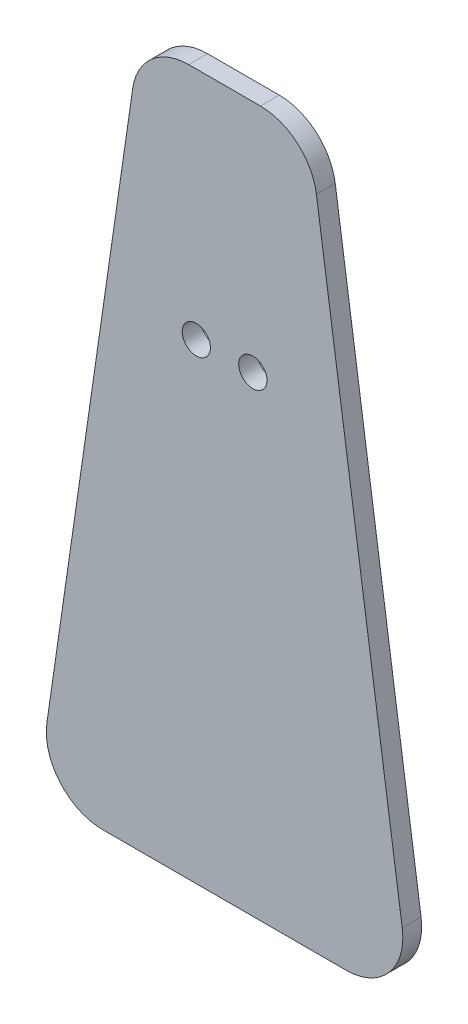
ISO-10303-21;
HEADER;
FILE_DESCRIPTION(('STEP AP214'),'2;1');
FILE_NAME('part.step','',(''),(''),'','','');
FILE_SCHEMA(('AUTOMOTIVE_DESIGN { 1 0 10303 214 1 1 1 1 }'));
ENDSEC;
DATA;
#1=APPLICATION_CONTEXT('core data for automotive mechanical design processes');
#2=APPLICATION_PROTOCOL_DEFINITION('international standard','automotive_design',2000,#1);
#3=PRODUCT_CONTEXT('',#1,'mechanical');
#4=PRODUCT('Part','Part','',(#3));
#5=PRODUCT_RELATED_PRODUCT_CATEGORY('part','',(#4));
#6=PRODUCT_DEFINITION_FORMATION('','',#4);
#7=PRODUCT_DEFINITION_CONTEXT('part definition',#1,'design');
#8=PRODUCT_DEFINITION('design','',#6,#7);
#9=PRODUCT_DEFINITION_SHAPE('','',#8);
#10=(LENGTH_UNIT() NAMED_UNIT(*) SI_UNIT(.MILLI.,.METRE.));
#11=(NAMED_UNIT(*) PLANE_ANGLE_UNIT() SI_UNIT($,.RADIAN.));
#12=(NAMED_UNIT(*) SI_UNIT($,.STERADIAN.) SOLID_ANGLE_UNIT());
#13=UNCERTAINTY_MEASURE_WITH_UNIT(LENGTH_MEASURE(1.E-05),#10,'distance_accuracy_value','');
#14=(GEOMETRIC_REPRESENTATION_CONTEXT(3) GLOBAL_UNCERTAINTY_ASSIGNED_CONTEXT((#13)) GLOBAL_UNIT_ASSIGNED_CONTEXT((#10,
#11,#12)) REPRESENTATION_CONTEXT('',''));
#15=CARTESIAN_POINT('',(0.,0.,0.));
#16=DIRECTION('',(0.,0.,1.));
#17=DIRECTION('',(1.,0.,0.));
#18=AXIS2_PLACEMENT_3D('',#15,#16,#17);
#19=CARTESIAN_POINT('',(-3.80670017831718,68.8779454447492,2.));
#20=DIRECTION('',(0.,0.,-1.));
#21=DIRECTION('',(-1.,0.,0.));
#22=AXIS2_PLACEMENT_3D('',#19,#20,#21);
#23=PLANE('',#22);
#24=DIRECTION('',(-1.,0.,0.));
#25=VECTOR('',#24,1.);
#26=CARTESIAN_POINT('',(0.,74.8779454447492,2.));
#27=LINE('',#26,#25);
#28=CARTESIAN_POINT('',(3.80670017831714,74.8779454447492,2.));
#29=VERTEX_POINT('',#28);
#30=CARTESIAN_POINT('',(-3.80670017831714,74.8779454447492,2.));
#31=VERTEX_POINT('',#30);
#32=EDGE_CURVE('E57',#29,#31,#27,.T.);
#33=ORIENTED_EDGE('',*,*,#32,.T.);
#34=CARTESIAN_POINT('',(-3.80670017831718,68.8779454447492,2.));
#35=DIRECTION('',(0.,0.,1.));
#36=DIRECTION('',(-1.,0.,0.));
#37=AXIS2_PLACEMENT_3D('',#34,#35,#36);
#38=CIRCLE('',#37,6.);
#39=CARTESIAN_POINT('',(-9.74469337261031,69.7383156119031,2.));
#40=VERTEX_POINT('',#39);
#41=EDGE_CURVE('E101',#31,#40,#38,.T.);
#42=ORIENTED_EDGE('',*,*,#41,.T.);
#43=DIRECTION('',(-0.143395027858991,-0.989665532382188,0.));
#44=VECTOR('',#43,1.);
#45=CARTESIAN_POINT('',(-9.74469337261031,69.7383156119031,2.));
#46=LINE('',#45,#44);
#47=CARTESIAN_POINT('',(-18.8552306639949,6.86037016715395,2.));
#48=VERTEX_POINT('',#47);
#49=EDGE_CURVE('E187',#40,#48,#46,.T.);
#50=ORIENTED_EDGE('',*,*,#49,.T.);
#51=CARTESIAN_POINT('',(-12.9172374697018,6.,2.));
#52=DIRECTION('',(0.,0.,1.));
#53=DIRECTION('',(1.,0.,0.));
#54=AXIS2_PLACEMENT_3D('',#51,#52,#53);
#55=CIRCLE('',#54,6.);
#56=CARTESIAN_POINT('',(-12.9172374697017,0.,2.));
#57=VERTEX_POINT('',#56);
#58=EDGE_CURVE('E202',#48,#57,#55,.T.);
#59=ORIENTED_EDGE('',*,*,#58,.T.);
#60=DIRECTION('',(1.,0.,0.));
#61=VECTOR('',#60,1.);
#62=CARTESIAN_POINT('',(-12.9172374697017,0.,2.));
#63=LINE('',#62,#61);
#64=CARTESIAN_POINT('',(12.9172374697017,0.,2.));
#65=VERTEX_POINT('',#64);
#66=EDGE_CURVE('E121',#57,#65,#63,.T.);
#67=ORIENTED_EDGE('',*,*,#66,.T.);
#68=CARTESIAN_POINT('',(12.9172374697018,6.,2.));
#69=DIRECTION('',(0.,0.,1.));
#70=DIRECTION('',(1.,0.,0.));
#71=AXIS2_PLACEMENT_3D('',#68,#69,#70);
#72=CIRCLE('',#71,6.);
#73=CARTESIAN_POINT('',(18.8552306639949,6.86037016715395,2.));
#74=VERTEX_POINT('',#73);
#75=EDGE_CURVE('E115',#65,#74,#72,.T.);
#76=ORIENTED_EDGE('',*,*,#75,.T.);
#77=DIRECTION('',(-0.143395027858991,0.989665532382188,0.));
#78=VECTOR('',#77,1.);
#79=CARTESIAN_POINT('',(9.7446933726103,69.7383156119031,2.));
#80=LINE('',#79,#78);
#81=CARTESIAN_POINT('',(9.74469337261031,69.7383156119031,2.));
#82=VERTEX_POINT('',#81);
#83=EDGE_CURVE('E119',#74,#82,#80,.T.);
#84=ORIENTED_EDGE('',*,*,#83,.T.);
#85=CARTESIAN_POINT('',(3.80670017831717,68.8779454447492,2.));
#86=DIRECTION('',(0.,0.,1.));
#87=DIRECTION('',(1.,0.,0.));
#88=AXIS2_PLACEMENT_3D('',#85,#86,#87);
#89=CIRCLE('',#88,6.);
#90=EDGE_CURVE('E138',#82,#29,#89,.T.);
#91=ORIENTED_EDGE('',*,*,#90,.T.);
#92=EDGE_LOOP('',(#33,#42,#50,#59,#67,#76,#84,#91));
#93=FACE_BOUND('',#92,.T.);
#94=CARTESIAN_POINT('',(-3.00000000000001,50.,2.));
#95=DIRECTION('',(0.,0.,1.));
#96=DIRECTION('',(1.,0.,0.));
#97=AXIS2_PLACEMENT_3D('',#94,#95,#96);
#98=CIRCLE('',#97,1.5);
#99=CARTESIAN_POINT('',(-1.50000000000001,50.,2.));
#100=VERTEX_POINT('',#99);
#101=EDGE_CURVE('E149',#100,#100,#98,.T.);
#102=ORIENTED_EDGE('',*,*,#101,.F.);
#103=EDGE_LOOP('',(#102));
#104=FACE_BOUND('',#103,.T.);
#105=CARTESIAN_POINT('',(2.99999999999999,50.,2.));
#106=DIRECTION('',(0.,0.,1.));
#107=DIRECTION('',(1.,0.,0.));
#108=AXIS2_PLACEMENT_3D('',#105,#106,#107);
#109=CIRCLE('',#108,1.5);
#110=CARTESIAN_POINT('',(4.49999999999999,50.,2.));
#111=VERTEX_POINT('',#110);
#112=EDGE_CURVE('E216',#111,#111,#109,.T.);
#113=ORIENTED_EDGE('',*,*,#112,.F.);
#114=EDGE_LOOP('',(#113));
#115=FACE_BOUND('',#114,.T.);
#116=ADVANCED_FACE('F39',(#93,#104,#115),#23,.F.);
#117=CARTESIAN_POINT('',(-3.80670017831718,68.8779454447492,0.));
#118=DIRECTION('',(0.,0.,-1.));
#119=DIRECTION('',(-1.,0.,0.));
#120=AXIS2_PLACEMENT_3D('',#117,#118,#119);
#121=PLANE('',#120);
#122=CARTESIAN_POINT('',(-3.00000000000001,50.,0.));
#123=DIRECTION('',(0.,0.,1.));
#124=DIRECTION('',(1.,0.,0.));
#125=AXIS2_PLACEMENT_3D('',#122,#123,#124);
#126=CIRCLE('',#125,1.5);
#127=CARTESIAN_POINT('',(-1.50000000000001,50.,0.));
#128=VERTEX_POINT('',#127);
#129=EDGE_CURVE('E212',#128,#128,#126,.T.);
#130=ORIENTED_EDGE('',*,*,#129,.T.);
#131=EDGE_LOOP('',(#130));
#132=FACE_BOUND('',#131,.T.);
#133=CARTESIAN_POINT('',(-3.80670017831718,68.8779454447492,0.));
#134=DIRECTION('',(0.,0.,1.));
#135=DIRECTION('',(-1.,0.,0.));
#136=AXIS2_PLACEMENT_3D('',#133,#134,#135);
#137=CIRCLE('',#136,6.);
#138=CARTESIAN_POINT('',(-3.80670017831714,74.8779454447492,0.));
#139=VERTEX_POINT('',#138);
#140=CARTESIAN_POINT('',(-9.74469337261031,69.7383156119031,0.));
#141=VERTEX_POINT('',#140);
#142=EDGE_CURVE('E145',#139,#141,#137,.T.);
#143=ORIENTED_EDGE('',*,*,#142,.F.);
#144=DIRECTION('',(-1.,0.,0.));
#145=VECTOR('',#144,1.);
#146=CARTESIAN_POINT('',(0.,74.8779454447492,0.));
#147=LINE('',#146,#145);
#148=CARTESIAN_POINT('',(3.80670017831714,74.8779454447492,0.));
#149=VERTEX_POINT('',#148);
#150=EDGE_CURVE('E164',#149,#139,#147,.T.);
#151=ORIENTED_EDGE('',*,*,#150,.F.);
#152=CARTESIAN_POINT('',(3.80670017831717,68.8779454447492,0.));
#153=DIRECTION('',(0.,0.,1.));
#154=DIRECTION('',(1.,0.,0.));
#155=AXIS2_PLACEMENT_3D('',#152,#153,#154);
#156=CIRCLE('',#155,6.);
#157=CARTESIAN_POINT('',(9.74469337261031,69.7383156119031,0.));
#158=VERTEX_POINT('',#157);
#159=EDGE_CURVE('E94',#158,#149,#156,.T.);
#160=ORIENTED_EDGE('',*,*,#159,.F.);
#161=DIRECTION('',(-0.143395027858991,0.989665532382188,0.));
#162=VECTOR('',#161,1.);
#163=CARTESIAN_POINT('',(9.7446933726103,69.7383156119031,0.));
#164=LINE('',#163,#162);
#165=CARTESIAN_POINT('',(18.8552306639949,6.86037016715395,0.));
#166=VERTEX_POINT('',#165);
#167=EDGE_CURVE('E87',#166,#158,#164,.T.);
#168=ORIENTED_EDGE('',*,*,#167,.F.);
#169=CARTESIAN_POINT('',(12.9172374697018,6.,0.));
#170=DIRECTION('',(0.,0.,1.));
#171=DIRECTION('',(1.,0.,0.));
#172=AXIS2_PLACEMENT_3D('',#169,#170,#171);
#173=CIRCLE('',#172,6.);
#174=CARTESIAN_POINT('',(12.9172374697017,0.,0.));
#175=VERTEX_POINT('',#174);
#176=EDGE_CURVE('E130',#175,#166,#173,.T.);
#177=ORIENTED_EDGE('',*,*,#176,.F.);
#178=DIRECTION('',(1.,0.,0.));
#179=VECTOR('',#178,1.);
#180=CARTESIAN_POINT('',(-12.9172374697017,0.,0.));
#181=LINE('',#180,#179);
#182=CARTESIAN_POINT('',(-12.9172374697017,0.,0.));
#183=VERTEX_POINT('',#182);
#184=EDGE_CURVE('E155',#183,#175,#181,.T.);
#185=ORIENTED_EDGE('',*,*,#184,.F.);
#186=CARTESIAN_POINT('',(-12.9172374697018,6.,0.));
#187=DIRECTION('',(0.,0.,1.));
#188=DIRECTION('',(1.,0.,0.));
#189=AXIS2_PLACEMENT_3D('',#186,#187,#188);
#190=CIRCLE('',#189,6.);
#191=CARTESIAN_POINT('',(-18.8552306639949,6.86037016715395,0.));
#192=VERTEX_POINT('',#191);
#193=EDGE_CURVE('E152',#192,#183,#190,.T.);
#194=ORIENTED_EDGE('',*,*,#193,.F.);
#195=DIRECTION('',(-0.143395027858991,-0.989665532382188,0.));
#196=VECTOR('',#195,1.);
#197=CARTESIAN_POINT('',(-9.74469337261031,69.7383156119031,0.));
#198=LINE('',#197,#196);
#199=EDGE_CURVE('E148',#141,#192,#198,.T.);
#200=ORIENTED_EDGE('',*,*,#199,.F.);
#201=EDGE_LOOP('',(#143,#151,#160,#168,#177,#185,#194,#200));
#202=FACE_BOUND('',#201,.T.);
#203=CARTESIAN_POINT('',(2.99999999999999,50.,0.));
#204=DIRECTION('',(0.,0.,1.));
#205=DIRECTION('',(1.,0.,0.));
#206=AXIS2_PLACEMENT_3D('',#203,#204,#205);
#207=CIRCLE('',#206,1.5);
#208=CARTESIAN_POINT('',(4.49999999999999,50.,0.));
#209=VERTEX_POINT('',#208);
#210=EDGE_CURVE('E220',#209,#209,#207,.T.);
#211=ORIENTED_EDGE('',*,*,#210,.T.);
#212=EDGE_LOOP('',(#211));
#213=FACE_BOUND('',#212,.T.);
#214=ADVANCED_FACE('F191',(#132,#202,#213),#121,.T.);
#215=CARTESIAN_POINT('',(-3.80670017831718,68.8779454447492,2.));
#216=DIRECTION('',(0.,0.,-1.));
#217=DIRECTION('',(-1.,0.,0.));
#218=AXIS2_PLACEMENT_3D('',#215,#216,#217);
#219=CYLINDRICAL_SURFACE('',#218,6.);
#220=ORIENTED_EDGE('',*,*,#142,.T.);
#221=DIRECTION('',(0.,0.,-1.));
#222=VECTOR('',#221,1.);
#223=CARTESIAN_POINT('',(-9.74469337261031,69.7383156119031,2.));
#224=LINE('',#223,#222);
#225=EDGE_CURVE('E49',#40,#141,#224,.T.);
#226=ORIENTED_EDGE('',*,*,#225,.F.);
#227=ORIENTED_EDGE('',*,*,#41,.F.);
#228=DIRECTION('',(0.,0.,-1.));
#229=VECTOR('',#228,1.);
#230=CARTESIAN_POINT('',(-3.80670017831714,74.8779454447492,2.));
#231=LINE('',#230,#229);
#232=EDGE_CURVE('E11',#31,#139,#231,.T.);
#233=ORIENTED_EDGE('',*,*,#232,.T.);
#234=EDGE_LOOP('',(#220,#226,#227,#233));
#235=FACE_BOUND('',#234,.T.);
#236=ADVANCED_FACE('F41',(#235),#219,.T.);
#237=CARTESIAN_POINT('',(-9.74469337261031,69.7383156119031,2.));
#238=DIRECTION('',(0.989665532382188,-0.143395027858991,0.));
#239=DIRECTION('',(0.143395027858991,0.989665532382188,0.));
#240=AXIS2_PLACEMENT_3D('',#237,#238,#239);
#241=PLANE('',#240);
#242=ORIENTED_EDGE('',*,*,#199,.T.);
#243=DIRECTION('',(0.,0.,-1.));
#244=VECTOR('',#243,1.);
#245=CARTESIAN_POINT('',(-18.8552306639949,6.86037016715395,2.));
#246=LINE('',#245,#244);
#247=EDGE_CURVE('E177',#48,#192,#246,.T.);
#248=ORIENTED_EDGE('',*,*,#247,.F.);
#249=ORIENTED_EDGE('',*,*,#49,.F.);
#250=ORIENTED_EDGE('',*,*,#225,.T.);
#251=EDGE_LOOP('',(#242,#248,#249,#250));
#252=FACE_BOUND('',#251,.T.);
#253=ADVANCED_FACE('F185',(#252),#241,.F.);
#254=CARTESIAN_POINT('',(-12.9172374697018,6.,2.));
#255=DIRECTION('',(0.,0.,-1.));
#256=DIRECTION('',(-1.,0.,0.));
#257=AXIS2_PLACEMENT_3D('',#254,#255,#256);
#258=CYLINDRICAL_SURFACE('',#257,6.);
#259=ORIENTED_EDGE('',*,*,#193,.T.);
#260=DIRECTION('',(0.,0.,-1.));
#261=VECTOR('',#260,1.);
#262=CARTESIAN_POINT('',(-12.9172374697017,0.,2.));
#263=LINE('',#262,#261);
#264=EDGE_CURVE('E173',#57,#183,#263,.T.);
#265=ORIENTED_EDGE('',*,*,#264,.F.);
#266=ORIENTED_EDGE('',*,*,#58,.F.);
#267=ORIENTED_EDGE('',*,*,#247,.T.);
#268=EDGE_LOOP('',(#259,#265,#266,#267));
#269=FACE_BOUND('',#268,.T.);
#270=ADVANCED_FACE('F197',(#269),#258,.T.);
#271=CARTESIAN_POINT('',(-12.9172374697017,0.,2.));
#272=DIRECTION('',(0.,1.,0.));
#273=DIRECTION('',(0.,0.,1.));
#274=AXIS2_PLACEMENT_3D('',#271,#272,#273);
#275=PLANE('',#274);
#276=ORIENTED_EDGE('',*,*,#184,.T.);
#277=DIRECTION('',(0.,0.,-1.));
#278=VECTOR('',#277,1.);
#279=CARTESIAN_POINT('',(12.9172374697017,0.,2.));
#280=LINE('',#279,#278);
#281=EDGE_CURVE('E132',#65,#175,#280,.T.);
#282=ORIENTED_EDGE('',*,*,#281,.F.);
#283=ORIENTED_EDGE('',*,*,#66,.F.);
#284=ORIENTED_EDGE('',*,*,#264,.T.);
#285=EDGE_LOOP('',(#276,#282,#283,#284));
#286=FACE_BOUND('',#285,.T.);
#287=ADVANCED_FACE('F200',(#286),#275,.F.);
#288=CARTESIAN_POINT('',(12.9172374697018,6.,2.));
#289=DIRECTION('',(0.,0.,-1.));
#290=DIRECTION('',(-1.,0.,0.));
#291=AXIS2_PLACEMENT_3D('',#288,#289,#290);
#292=CYLINDRICAL_SURFACE('',#291,6.);
#293=ORIENTED_EDGE('',*,*,#176,.T.);
#294=DIRECTION('',(0.,0.,-1.));
#295=VECTOR('',#294,1.);
#296=CARTESIAN_POINT('',(18.8552306639949,6.86037016715395,2.));
#297=LINE('',#296,#295);
#298=EDGE_CURVE('E127',#74,#166,#297,.T.);
#299=ORIENTED_EDGE('',*,*,#298,.F.);
#300=ORIENTED_EDGE('',*,*,#75,.F.);
#301=ORIENTED_EDGE('',*,*,#281,.T.);
#302=EDGE_LOOP('',(#293,#299,#300,#301));
#303=FACE_BOUND('',#302,.T.);
#304=ADVANCED_FACE('F128',(#303),#292,.T.);
#305=CARTESIAN_POINT('',(9.7446933726103,69.7383156119031,2.));
#306=DIRECTION('',(-0.989665532382188,-0.143395027858991,0.));
#307=DIRECTION('',(0.143395027858991,-0.989665532382188,0.));
#308=AXIS2_PLACEMENT_3D('',#305,#306,#307);
#309=PLANE('',#308);
#310=ORIENTED_EDGE('',*,*,#167,.T.);
#311=DIRECTION('',(0.,0.,-1.));
#312=VECTOR('',#311,1.);
#313=CARTESIAN_POINT('',(9.74469337261031,69.7383156119031,2.));
#314=LINE('',#313,#312);
#315=EDGE_CURVE('E133',#82,#158,#314,.T.);
#316=ORIENTED_EDGE('',*,*,#315,.F.);
#317=ORIENTED_EDGE('',*,*,#83,.F.);
#318=ORIENTED_EDGE('',*,*,#298,.T.);
#319=EDGE_LOOP('',(#310,#316,#317,#318));
#320=FACE_BOUND('',#319,.T.);
#321=ADVANCED_FACE('F135',(#320),#309,.F.);
#322=CARTESIAN_POINT('',(3.80670017831717,68.8779454447492,2.));
#323=DIRECTION('',(0.,0.,-1.));
#324=DIRECTION('',(-1.,0.,0.));
#325=AXIS2_PLACEMENT_3D('',#322,#323,#324);
#326=CYLINDRICAL_SURFACE('',#325,6.);
#327=ORIENTED_EDGE('',*,*,#159,.T.);
#328=DIRECTION('',(0.,0.,-1.));
#329=VECTOR('',#328,1.);
#330=CARTESIAN_POINT('',(3.80670017831714,74.8779454447492,2.));
#331=LINE('',#330,#329);
#332=EDGE_CURVE('E141',#29,#149,#331,.T.);
#333=ORIENTED_EDGE('',*,*,#332,.F.);
#334=ORIENTED_EDGE('',*,*,#90,.F.);
#335=ORIENTED_EDGE('',*,*,#315,.T.);
#336=EDGE_LOOP('',(#327,#333,#334,#335));
#337=FACE_BOUND('',#336,.T.);
#338=ADVANCED_FACE('F245',(#337),#326,.T.);
#339=CARTESIAN_POINT('',(0.,74.8779454447492,2.));
#340=DIRECTION('',(0.,-1.,0.));
#341=DIRECTION('',(0.,0.,-1.));
#342=AXIS2_PLACEMENT_3D('',#339,#340,#341);
#343=PLANE('',#342);
#344=ORIENTED_EDGE('',*,*,#150,.T.);
#345=ORIENTED_EDGE('',*,*,#232,.F.);
#346=ORIENTED_EDGE('',*,*,#32,.F.);
#347=ORIENTED_EDGE('',*,*,#332,.T.);
#348=EDGE_LOOP('',(#344,#345,#346,#347));
#349=FACE_BOUND('',#348,.T.);
#350=ADVANCED_FACE('F242',(#349),#343,.F.);
#351=CARTESIAN_POINT('',(-3.00000000000001,50.,2.));
#352=DIRECTION('',(0.,0.,-1.));
#353=DIRECTION('',(-1.,0.,0.));
#354=AXIS2_PLACEMENT_3D('',#351,#352,#353);
#355=CYLINDRICAL_SURFACE('',#354,1.5);
#356=ORIENTED_EDGE('',*,*,#101,.T.);
#357=EDGE_LOOP('',(#356));
#358=FACE_BOUND('',#357,.T.);
#359=ORIENTED_EDGE('',*,*,#129,.F.);
#360=EDGE_LOOP('',(#359));
#361=FACE_BOUND('',#360,.T.);
#362=ADVANCED_FACE('F239',(#358,#361),#355,.F.);
#363=CARTESIAN_POINT('',(2.99999999999999,50.,2.));
#364=DIRECTION('',(0.,0.,-1.));
#365=DIRECTION('',(-1.,0.,0.));
#366=AXIS2_PLACEMENT_3D('',#363,#364,#365);
#367=CYLINDRICAL_SURFACE('',#366,1.5);
#368=ORIENTED_EDGE('',*,*,#112,.T.);
#369=EDGE_LOOP('',(#368));
#370=FACE_BOUND('',#369,.T.);
#371=ORIENTED_EDGE('',*,*,#210,.F.);
#372=EDGE_LOOP('',(#371));
#373=FACE_BOUND('',#372,.T.);
#374=ADVANCED_FACE('F228',(#370,#373),#367,.F.);
#375=CLOSED_SHELL('',(#116,#214,#236,#253,#270,#287,#304,#321,#338,#350,#362,#374));
#376=MANIFOLD_SOLID_BREP('B2',#375);
#377=ADVANCED_BREP_SHAPE_REPRESENTATION('',(#18,#376),#14);
#378=SHAPE_DEFINITION_REPRESENTATION(#9,#377);
ENDSEC;
END-ISO-10303-21;
